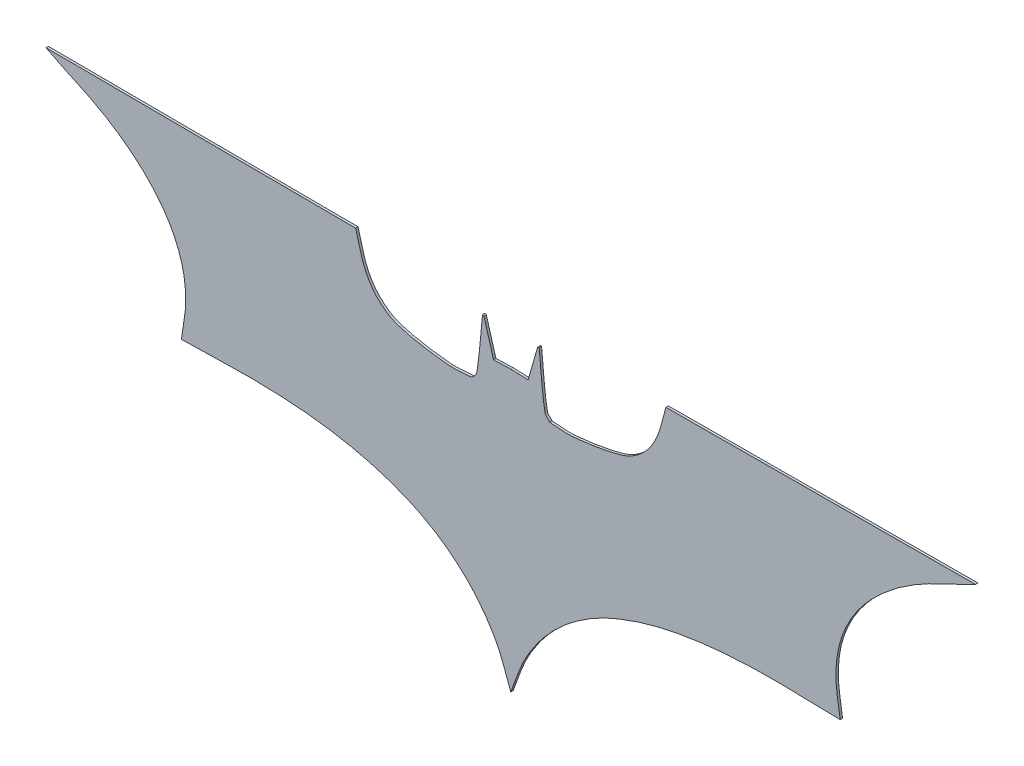
ISO-10303-21;
HEADER;
FILE_DESCRIPTION(('STEP AP214'),'2;1');
FILE_NAME('part.step','',(''),(''),'','','');
FILE_SCHEMA(('AUTOMOTIVE_DESIGN { 1 0 10303 214 1 1 1 1 }'));
ENDSEC;
DATA;
#1=APPLICATION_CONTEXT('core data for automotive mechanical design processes');
#2=APPLICATION_PROTOCOL_DEFINITION('international standard','automotive_design',2000,#1);
#3=PRODUCT_CONTEXT('',#1,'mechanical');
#4=PRODUCT('Part','Part','',(#3));
#5=PRODUCT_RELATED_PRODUCT_CATEGORY('part','',(#4));
#6=PRODUCT_DEFINITION_FORMATION('','',#4);
#7=PRODUCT_DEFINITION_CONTEXT('part definition',#1,'design');
#8=PRODUCT_DEFINITION('design','',#6,#7);
#9=PRODUCT_DEFINITION_SHAPE('','',#8);
#10=(LENGTH_UNIT() NAMED_UNIT(*) SI_UNIT(.MILLI.,.METRE.));
#11=(NAMED_UNIT(*) PLANE_ANGLE_UNIT() SI_UNIT($,.RADIAN.));
#12=(NAMED_UNIT(*) SI_UNIT($,.STERADIAN.) SOLID_ANGLE_UNIT());
#13=UNCERTAINTY_MEASURE_WITH_UNIT(LENGTH_MEASURE(1.E-05),#10,'distance_accuracy_value','');
#14=(GEOMETRIC_REPRESENTATION_CONTEXT(3) GLOBAL_UNCERTAINTY_ASSIGNED_CONTEXT((#13)) GLOBAL_UNIT_ASSIGNED_CONTEXT((#10,
#11,#12)) REPRESENTATION_CONTEXT('',''));
#15=CARTESIAN_POINT('',(0.,0.,0.));
#16=DIRECTION('',(0.,0.,1.));
#17=DIRECTION('',(1.,0.,0.));
#18=AXIS2_PLACEMENT_3D('',#15,#16,#17);
#19=CARTESIAN_POINT('',(24.,709.,5.));
#20=CARTESIAN_POINT('',(64.0321290435499,687.444238207319,5.));
#21=CARTESIAN_POINT('',(106.843725270585,671.108621151786,5.));
#22=CARTESIAN_POINT('',(146.,648.,5.));
#23=CARTESIAN_POINT('',(172.297790869574,632.479992273694,5.));
#24=CARTESIAN_POINT('',(197.276133100903,614.397801783441,5.));
#25=CARTESIAN_POINT('',(220.,594.,5.));
#26=CARTESIAN_POINT('',(239.858417409562,576.174333978818,5.));
#27=CARTESIAN_POINT('',(258.07626884736,556.122236767443,5.));
#28=CARTESIAN_POINT('',(273.,534.,5.));
#29=CARTESIAN_POINT('',(286.673302399037,513.731339973193,5.));
#30=CARTESIAN_POINT('',(297.687502708865,491.330348500289,5.));
#31=CARTESIAN_POINT('',(305.,468.,5.));
#32=CARTESIAN_POINT('',(311.852192021314,446.138244503427,5.));
#33=CARTESIAN_POINT('',(314.840903463254,422.909901291382,5.));
#34=CARTESIAN_POINT('',(315.,400.,5.));
#35=CARTESIAN_POINT('',(315.177150912395,374.490268615056,5.));
#36=CARTESIAN_POINT('',(309.,349.333333333333,5.));
#37=CARTESIAN_POINT('',(306.,324.,5.));
#38=B_SPLINE_CURVE_WITH_KNOTS('',3,(#19,#20,#21,#22,#23,#24,#25,#26,#27,#28,#29,#30,#31,#32,#33,
#34,#35,#36,#37),.UNSPECIFIED.,.F.,.F.,(4,3,3,3,3,3,4),(0.,1.,2.,3.,4.,5.,6.),.UNSPECIFIED.);
#39=DIRECTION('',(0.,0.,-1.));
#40=VECTOR('',#39,1.);
#41=SURFACE_OF_LINEAR_EXTRUSION('',#38,#40);
#42=CARTESIAN_POINT('',(24.,709.,0.));
#43=CARTESIAN_POINT('',(64.0321290435499,687.444238207319,0.));
#44=CARTESIAN_POINT('',(106.843725270585,671.108621151786,0.));
#45=CARTESIAN_POINT('',(146.,648.,0.));
#46=CARTESIAN_POINT('',(172.297790869574,632.479992273694,0.));
#47=CARTESIAN_POINT('',(197.276133100903,614.397801783441,0.));
#48=CARTESIAN_POINT('',(220.,594.,0.));
#49=CARTESIAN_POINT('',(239.858417409562,576.174333978818,0.));
#50=CARTESIAN_POINT('',(258.07626884736,556.122236767443,0.));
#51=CARTESIAN_POINT('',(273.,534.,0.));
#52=CARTESIAN_POINT('',(286.673302399037,513.731339973193,0.));
#53=CARTESIAN_POINT('',(297.687502708865,491.330348500289,0.));
#54=CARTESIAN_POINT('',(305.,468.,0.));
#55=CARTESIAN_POINT('',(311.852192021314,446.138244503427,0.));
#56=CARTESIAN_POINT('',(314.840903463254,422.909901291382,0.));
#57=CARTESIAN_POINT('',(315.,400.,0.));
#58=CARTESIAN_POINT('',(315.177150912395,374.490268615056,0.));
#59=CARTESIAN_POINT('',(309.,349.333333333333,0.));
#60=CARTESIAN_POINT('',(306.,324.,0.));
#61=B_SPLINE_CURVE_WITH_KNOTS('',3,(#42,#43,#44,#45,#46,#47,#48,#49,#50,#51,#52,#53,#54,#55,#56,
#57,#58,#59,#60),.UNSPECIFIED.,.F.,.F.,(4,3,3,3,3,3,4),(0.,1.,2.,3.,4.,5.,6.),.UNSPECIFIED.);
#62=CARTESIAN_POINT('',(24.,709.,0.));
#63=VERTEX_POINT('',#62);
#64=CARTESIAN_POINT('',(306.,324.,0.));
#65=VERTEX_POINT('',#64);
#66=EDGE_CURVE('E307',#63,#65,#61,.T.);
#67=ORIENTED_EDGE('',*,*,#66,.T.);
#68=DIRECTION('',(0.,0.,-1.));
#69=VECTOR('',#68,1.);
#70=CARTESIAN_POINT('',(306.,324.,5.));
#71=LINE('',#70,#69);
#72=CARTESIAN_POINT('',(306.,324.,5.));
#73=VERTEX_POINT('',#72);
#74=EDGE_CURVE('E11',#73,#65,#71,.T.);
#75=ORIENTED_EDGE('',*,*,#74,.F.);
#76=CARTESIAN_POINT('',(24.,709.,5.));
#77=VERTEX_POINT('',#76);
#78=EDGE_CURVE('E360',#77,#73,#38,.T.);
#79=ORIENTED_EDGE('',*,*,#78,.F.);
#80=DIRECTION('',(0.,0.,-1.));
#81=VECTOR('',#80,1.);
#82=CARTESIAN_POINT('',(24.,709.,5.));
#83=LINE('',#82,#81);
#84=EDGE_CURVE('E174',#77,#63,#83,.T.);
#85=ORIENTED_EDGE('',*,*,#84,.T.);
#86=EDGE_LOOP('',(#67,#75,#79,#85));
#87=FACE_BOUND('',#86,.T.);
#88=ADVANCED_FACE('F33',(#87),#41,.F.);
#89=CARTESIAN_POINT('',(306.,324.,5.));
#90=CARTESIAN_POINT('',(336.,324.666666666667,5.));
#91=CARTESIAN_POINT('',(366.0081939272,325.032522384748,5.));
#92=CARTESIAN_POINT('',(396.,326.,5.));
#93=CARTESIAN_POINT('',(450.321435164384,327.752304360141,5.));
#94=CARTESIAN_POINT('',(504.859669997663,326.765874119924,5.));
#95=CARTESIAN_POINT('',(559.,322.,5.));
#96=CARTESIAN_POINT('',(600.706237792641,318.328676250648,5.));
#97=CARTESIAN_POINT('',(642.288559158832,311.77074580188,5.));
#98=CARTESIAN_POINT('',(683.,302.,5.));
#99=CARTESIAN_POINT('',(717.542187487519,293.709875002995,5.));
#100=CARTESIAN_POINT('',(751.485195049652,282.306514178153,5.));
#101=CARTESIAN_POINT('',(784.,268.,5.));
#102=CARTESIAN_POINT('',(810.112782699585,256.510375612182,5.));
#103=CARTESIAN_POINT('',(834.950283850925,241.810695236544,5.));
#104=CARTESIAN_POINT('',(858.,225.,5.));
#105=CARTESIAN_POINT('',(879.540210465079,209.290222442762,5.));
#106=CARTESIAN_POINT('',(899.455939229453,191.074454150914,5.));
#107=CARTESIAN_POINT('',(917.,171.,5.));
#108=CARTESIAN_POINT('',(934.341312172488,151.157537033403,5.));
#109=CARTESIAN_POINT('',(949.555873137911,129.229036809233,5.));
#110=CARTESIAN_POINT('',(962.,106.,5.));
#111=CARTESIAN_POINT('',(974.714950659267,82.2654254360351,5.));
#112=CARTESIAN_POINT('',(982.,55.9999999999999,5.));
#113=CARTESIAN_POINT('',(992.,31.,5.));
#114=B_SPLINE_CURVE_WITH_KNOTS('',3,(#89,#90,#91,#92,#93,#94,#95,#96,#97,#98,#99,#100,#101,#102,
#103,#104,#105,#106,#107,#108,#109,#110,#111,#112,#113),.UNSPECIFIED.,.F.,.F.,(4,3,3,3,3,3,3,3,
4),(0.,1.,2.,3.,4.,5.,6.,7.,8.),.UNSPECIFIED.);
#115=DIRECTION('',(0.,0.,-1.));
#116=VECTOR('',#115,1.);
#117=SURFACE_OF_LINEAR_EXTRUSION('',#114,#116);
#118=CARTESIAN_POINT('',(306.,324.,0.));
#119=CARTESIAN_POINT('',(336.,324.666666666667,0.));
#120=CARTESIAN_POINT('',(366.0081939272,325.032522384748,0.));
#121=CARTESIAN_POINT('',(396.,326.,0.));
#122=CARTESIAN_POINT('',(450.321435164384,327.752304360141,0.));
#123=CARTESIAN_POINT('',(504.859669997663,326.765874119924,0.));
#124=CARTESIAN_POINT('',(559.,322.,0.));
#125=CARTESIAN_POINT('',(600.706237792641,318.328676250648,0.));
#126=CARTESIAN_POINT('',(642.288559158832,311.77074580188,0.));
#127=CARTESIAN_POINT('',(683.,302.,0.));
#128=CARTESIAN_POINT('',(717.542187487519,293.709875002995,0.));
#129=CARTESIAN_POINT('',(751.485195049652,282.306514178153,0.));
#130=CARTESIAN_POINT('',(784.,268.,0.));
#131=CARTESIAN_POINT('',(810.112782699585,256.510375612182,0.));
#132=CARTESIAN_POINT('',(834.950283850925,241.810695236544,0.));
#133=CARTESIAN_POINT('',(858.,225.,0.));
#134=CARTESIAN_POINT('',(879.540210465079,209.290222442762,0.));
#135=CARTESIAN_POINT('',(899.455939229453,191.074454150914,0.));
#136=CARTESIAN_POINT('',(917.,171.,0.));
#137=CARTESIAN_POINT('',(934.341312172488,151.157537033403,0.));
#138=CARTESIAN_POINT('',(949.555873137911,129.229036809233,0.));
#139=CARTESIAN_POINT('',(962.,106.,0.));
#140=CARTESIAN_POINT('',(974.714950659267,82.2654254360351,0.));
#141=CARTESIAN_POINT('',(982.,55.9999999999999,0.));
#142=CARTESIAN_POINT('',(992.,31.,0.));
#143=B_SPLINE_CURVE_WITH_KNOTS('',3,(#118,#119,#120,#121,#122,#123,#124,#125,#126,#127,#128,
#129,#130,#131,#132,#133,#134,#135,#136,#137,#138,#139,#140,#141,#142),.UNSPECIFIED.,.F.,.F.,(4,
3,3,3,3,3,3,3,4),(0.,1.,2.,3.,4.,5.,6.,7.,8.),.UNSPECIFIED.);
#144=CARTESIAN_POINT('',(992.,31.,0.));
#145=VERTEX_POINT('',#144);
#146=EDGE_CURVE('E301',#65,#145,#143,.T.);
#147=ORIENTED_EDGE('',*,*,#146,.T.);
#148=DIRECTION('',(0.,0.,-1.));
#149=VECTOR('',#148,1.);
#150=CARTESIAN_POINT('',(992.,31.,5.));
#151=LINE('',#150,#149);
#152=CARTESIAN_POINT('',(992.,31.,5.));
#153=VERTEX_POINT('',#152);
#154=EDGE_CURVE('E42',#153,#145,#151,.T.);
#155=ORIENTED_EDGE('',*,*,#154,.F.);
#156=EDGE_CURVE('E117',#73,#153,#114,.T.);
#157=ORIENTED_EDGE('',*,*,#156,.F.);
#158=ORIENTED_EDGE('',*,*,#74,.T.);
#159=EDGE_LOOP('',(#147,#155,#157,#158));
#160=FACE_BOUND('',#159,.T.);
#161=ADVANCED_FACE('F388',(#160),#117,.F.);
#162=CARTESIAN_POINT('',(992.,31.,5.));
#163=CARTESIAN_POINT('',(1002.,55.9999999999999,5.));
#164=CARTESIAN_POINT('',(1009.28504934073,82.2654254360351,5.));
#165=CARTESIAN_POINT('',(1022.,106.,5.));
#166=CARTESIAN_POINT('',(1034.44412686209,129.229036809233,5.));
#167=CARTESIAN_POINT('',(1049.65868782751,151.157537033403,5.));
#168=CARTESIAN_POINT('',(1067.,171.,5.));
#169=CARTESIAN_POINT('',(1084.54406077055,191.074454150914,5.));
#170=CARTESIAN_POINT('',(1104.45978953492,209.290222442762,5.));
#171=CARTESIAN_POINT('',(1126.,225.,5.));
#172=CARTESIAN_POINT('',(1149.04971614908,241.810695236544,5.));
#173=CARTESIAN_POINT('',(1173.88721730041,256.510375612182,5.));
#174=CARTESIAN_POINT('',(1200.,268.,5.));
#175=CARTESIAN_POINT('',(1232.51480495035,282.306514178153,5.));
#176=CARTESIAN_POINT('',(1266.45781251248,293.709875002995,5.));
#177=CARTESIAN_POINT('',(1301.,302.,5.));
#178=CARTESIAN_POINT('',(1341.71144084117,311.77074580188,5.));
#179=CARTESIAN_POINT('',(1383.29376220736,318.328676250648,5.));
#180=CARTESIAN_POINT('',(1425.,322.,5.));
#181=CARTESIAN_POINT('',(1479.14033000234,326.765874119924,5.));
#182=CARTESIAN_POINT('',(1533.67856483562,327.752304360141,5.));
#183=CARTESIAN_POINT('',(1588.,326.,5.));
#184=CARTESIAN_POINT('',(1617.9918060728,325.032522384748,5.));
#185=CARTESIAN_POINT('',(1648.,324.666666666667,5.));
#186=CARTESIAN_POINT('',(1678.,324.,5.));
#187=B_SPLINE_CURVE_WITH_KNOTS('',3,(#162,#163,#164,#165,#166,#167,#168,#169,#170,#171,#172,
#173,#174,#175,#176,#177,#178,#179,#180,#181,#182,#183,#184,#185,#186),.UNSPECIFIED.,.F.,.F.,(4,
3,3,3,3,3,3,3,4),(0.,1.,2.,3.,4.,5.,6.,7.,8.),.UNSPECIFIED.);
#188=DIRECTION('',(0.,0.,-1.));
#189=VECTOR('',#188,1.);
#190=SURFACE_OF_LINEAR_EXTRUSION('',#187,#189);
#191=CARTESIAN_POINT('',(992.,31.,0.));
#192=CARTESIAN_POINT('',(1002.,55.9999999999999,0.));
#193=CARTESIAN_POINT('',(1009.28504934073,82.2654254360351,0.));
#194=CARTESIAN_POINT('',(1022.,106.,0.));
#195=CARTESIAN_POINT('',(1034.44412686209,129.229036809233,0.));
#196=CARTESIAN_POINT('',(1049.65868782751,151.157537033403,0.));
#197=CARTESIAN_POINT('',(1067.,171.,0.));
#198=CARTESIAN_POINT('',(1084.54406077055,191.074454150914,0.));
#199=CARTESIAN_POINT('',(1104.45978953492,209.290222442762,0.));
#200=CARTESIAN_POINT('',(1126.,225.,0.));
#201=CARTESIAN_POINT('',(1149.04971614908,241.810695236544,0.));
#202=CARTESIAN_POINT('',(1173.88721730041,256.510375612182,0.));
#203=CARTESIAN_POINT('',(1200.,268.,0.));
#204=CARTESIAN_POINT('',(1232.51480495035,282.306514178153,0.));
#205=CARTESIAN_POINT('',(1266.45781251248,293.709875002995,0.));
#206=CARTESIAN_POINT('',(1301.,302.,0.));
#207=CARTESIAN_POINT('',(1341.71144084117,311.77074580188,0.));
#208=CARTESIAN_POINT('',(1383.29376220736,318.328676250648,0.));
#209=CARTESIAN_POINT('',(1425.,322.,0.));
#210=CARTESIAN_POINT('',(1479.14033000234,326.765874119924,0.));
#211=CARTESIAN_POINT('',(1533.67856483562,327.752304360141,0.));
#212=CARTESIAN_POINT('',(1588.,326.,0.));
#213=CARTESIAN_POINT('',(1617.9918060728,325.032522384748,0.));
#214=CARTESIAN_POINT('',(1648.,324.666666666667,0.));
#215=CARTESIAN_POINT('',(1678.,324.,0.));
#216=B_SPLINE_CURVE_WITH_KNOTS('',3,(#191,#192,#193,#194,#195,#196,#197,#198,#199,#200,#201,
#202,#203,#204,#205,#206,#207,#208,#209,#210,#211,#212,#213,#214,#215),.UNSPECIFIED.,.F.,.F.,(4,
3,3,3,3,3,3,3,4),(0.,1.,2.,3.,4.,5.,6.,7.,8.),.UNSPECIFIED.);
#217=CARTESIAN_POINT('',(1678.,324.,0.));
#218=VERTEX_POINT('',#217);
#219=EDGE_CURVE('E295',#145,#218,#216,.T.);
#220=ORIENTED_EDGE('',*,*,#219,.T.);
#221=DIRECTION('',(0.,0.,-1.));
#222=VECTOR('',#221,1.);
#223=CARTESIAN_POINT('',(1678.,324.,5.));
#224=LINE('',#223,#222);
#225=CARTESIAN_POINT('',(1678.,324.,5.));
#226=VERTEX_POINT('',#225);
#227=EDGE_CURVE('E287',#226,#218,#224,.T.);
#228=ORIENTED_EDGE('',*,*,#227,.F.);
#229=EDGE_CURVE('E296',#153,#226,#187,.T.);
#230=ORIENTED_EDGE('',*,*,#229,.F.);
#231=ORIENTED_EDGE('',*,*,#154,.T.);
#232=EDGE_LOOP('',(#220,#228,#230,#231));
#233=FACE_BOUND('',#232,.T.);
#234=ADVANCED_FACE('F293',(#233),#190,.F.);
#235=CARTESIAN_POINT('',(1678.,324.,5.));
#236=CARTESIAN_POINT('',(1675.,349.333333333333,5.));
#237=CARTESIAN_POINT('',(1668.8228490876,374.490268615056,5.));
#238=CARTESIAN_POINT('',(1669.,400.,5.));
#239=CARTESIAN_POINT('',(1669.15909653675,422.909901291382,5.));
#240=CARTESIAN_POINT('',(1672.14780797869,446.138244503427,5.));
#241=CARTESIAN_POINT('',(1679.,468.,5.));
#242=CARTESIAN_POINT('',(1686.31249729114,491.330348500289,5.));
#243=CARTESIAN_POINT('',(1697.32669760096,513.731339973193,5.));
#244=CARTESIAN_POINT('',(1711.,534.,5.));
#245=CARTESIAN_POINT('',(1725.92373115264,556.122236767443,5.));
#246=CARTESIAN_POINT('',(1744.14158259044,576.174333978818,5.));
#247=CARTESIAN_POINT('',(1764.,594.,5.));
#248=CARTESIAN_POINT('',(1786.7238668991,614.397801783441,5.));
#249=CARTESIAN_POINT('',(1811.70220913043,632.479992273694,5.));
#250=CARTESIAN_POINT('',(1838.,648.,5.));
#251=CARTESIAN_POINT('',(1877.15627472942,671.108621151786,5.));
#252=CARTESIAN_POINT('',(1919.96787095645,687.444238207319,5.));
#253=CARTESIAN_POINT('',(1960.,709.,5.));
#254=B_SPLINE_CURVE_WITH_KNOTS('',3,(#235,#236,#237,#238,#239,#240,#241,#242,#243,#244,#245,
#246,#247,#248,#249,#250,#251,#252,#253),.UNSPECIFIED.,.F.,.F.,(4,3,3,3,3,3,4),(0.,1.,2.,3.,4.,
5.,6.),.UNSPECIFIED.);
#255=DIRECTION('',(0.,0.,-1.));
#256=VECTOR('',#255,1.);
#257=SURFACE_OF_LINEAR_EXTRUSION('',#254,#256);
#258=CARTESIAN_POINT('',(1678.,324.,0.));
#259=CARTESIAN_POINT('',(1675.,349.333333333333,0.));
#260=CARTESIAN_POINT('',(1668.8228490876,374.490268615056,0.));
#261=CARTESIAN_POINT('',(1669.,400.,0.));
#262=CARTESIAN_POINT('',(1669.15909653675,422.909901291382,0.));
#263=CARTESIAN_POINT('',(1672.14780797869,446.138244503427,0.));
#264=CARTESIAN_POINT('',(1679.,468.,0.));
#265=CARTESIAN_POINT('',(1686.31249729114,491.330348500289,0.));
#266=CARTESIAN_POINT('',(1697.32669760096,513.731339973193,0.));
#267=CARTESIAN_POINT('',(1711.,534.,0.));
#268=CARTESIAN_POINT('',(1725.92373115264,556.122236767443,0.));
#269=CARTESIAN_POINT('',(1744.14158259044,576.174333978818,0.));
#270=CARTESIAN_POINT('',(1764.,594.,0.));
#271=CARTESIAN_POINT('',(1786.7238668991,614.397801783441,0.));
#272=CARTESIAN_POINT('',(1811.70220913043,632.479992273694,0.));
#273=CARTESIAN_POINT('',(1838.,648.,0.));
#274=CARTESIAN_POINT('',(1877.15627472942,671.108621151786,0.));
#275=CARTESIAN_POINT('',(1919.96787095645,687.444238207319,0.));
#276=CARTESIAN_POINT('',(1960.,709.,0.));
#277=B_SPLINE_CURVE_WITH_KNOTS('',3,(#258,#259,#260,#261,#262,#263,#264,#265,#266,#267,#268,
#269,#270,#271,#272,#273,#274,#275,#276),.UNSPECIFIED.,.F.,.F.,(4,3,3,3,3,3,4),(0.,1.,2.,3.,4.,
5.,6.),.UNSPECIFIED.);
#278=CARTESIAN_POINT('',(1960.,709.,0.));
#279=VERTEX_POINT('',#278);
#280=EDGE_CURVE('E303',#218,#279,#277,.T.);
#281=ORIENTED_EDGE('',*,*,#280,.T.);
#282=DIRECTION('',(0.,0.,-1.));
#283=VECTOR('',#282,1.);
#284=CARTESIAN_POINT('',(1960.,709.,5.));
#285=LINE('',#284,#283);
#286=CARTESIAN_POINT('',(1960.,709.,5.));
#287=VERTEX_POINT('',#286);
#288=EDGE_CURVE('E284',#287,#279,#285,.T.);
#289=ORIENTED_EDGE('',*,*,#288,.F.);
#290=EDGE_CURVE('E397',#226,#287,#254,.T.);
#291=ORIENTED_EDGE('',*,*,#290,.F.);
#292=ORIENTED_EDGE('',*,*,#227,.T.);
#293=EDGE_LOOP('',(#281,#289,#291,#292));
#294=FACE_BOUND('',#293,.T.);
#295=ADVANCED_FACE('F393',(#294),#257,.F.);
#296=CARTESIAN_POINT('',(1960.,709.,5.));
#297=DIRECTION('',(0.00465111248147835,-0.999989183517844,0.));
#298=DIRECTION('',(0.999989183517844,0.00465111248147835,0.));
#299=AXIS2_PLACEMENT_3D('',#296,#297,#298);
#300=PLANE('',#299);
#301=DIRECTION('',(-0.999989183517844,-0.00465111248147835,0.));
#302=VECTOR('',#301,1.);
#303=CARTESIAN_POINT('',(1960.,709.,0.));
#304=LINE('',#303,#302);
#305=CARTESIAN_POINT('',(1315.,706.,0.));
#306=VERTEX_POINT('',#305);
#307=EDGE_CURVE('E305',#279,#306,#304,.T.);
#308=ORIENTED_EDGE('',*,*,#307,.T.);
#309=DIRECTION('',(0.,0.,-1.));
#310=VECTOR('',#309,1.);
#311=CARTESIAN_POINT('',(1315.,706.,5.));
#312=LINE('',#311,#310);
#313=CARTESIAN_POINT('',(1315.,706.,5.));
#314=VERTEX_POINT('',#313);
#315=EDGE_CURVE('E281',#314,#306,#312,.T.);
#316=ORIENTED_EDGE('',*,*,#315,.F.);
#317=DIRECTION('',(-0.999989183517844,-0.00465111248147835,0.));
#318=VECTOR('',#317,1.);
#319=CARTESIAN_POINT('',(1960.,709.,5.));
#320=LINE('',#319,#318);
#321=EDGE_CURVE('E401',#287,#314,#320,.T.);
#322=ORIENTED_EDGE('',*,*,#321,.F.);
#323=ORIENTED_EDGE('',*,*,#288,.T.);
#324=EDGE_LOOP('',(#308,#316,#322,#323));
#325=FACE_BOUND('',#324,.T.);
#326=ADVANCED_FACE('F395',(#325),#300,.F.);
#327=CARTESIAN_POINT('',(1315.,706.,5.));
#328=CARTESIAN_POINT('',(1308.33333333333,684.,5.));
#329=CARTESIAN_POINT('',(1304.5712985177,660.900590640687,5.));
#330=CARTESIAN_POINT('',(1295.,640.,5.));
#331=CARTESIAN_POINT('',(1288.03016527678,624.780156828888,5.));
#332=CARTESIAN_POINT('',(1278.26069310113,610.397264009498,5.));
#333=CARTESIAN_POINT('',(1266.,599.,5.));
#334=CARTESIAN_POINT('',(1254.06697486362,587.907328746465,5.));
#335=CARTESIAN_POINT('',(1239.593210718,578.721887752634,5.));
#336=CARTESIAN_POINT('',(1224.,574.,5.));
#337=CARTESIAN_POINT('',(1191.58459360188,564.184067076627,5.));
#338=CARTESIAN_POINT('',(1157.68048143256,559.568792734575,5.));
#339=CARTESIAN_POINT('',(1124.,556.,5.));
#340=CARTESIAN_POINT('',(1107.08164410277,554.207326527446,5.));
#341=CARTESIAN_POINT('',(1090.,557.333333333333,5.));
#342=CARTESIAN_POINT('',(1073.,558.,5.));
#343=B_SPLINE_CURVE_WITH_KNOTS('',3,(#327,#328,#329,#330,#331,#332,#333,#334,#335,#336,#337,
#338,#339,#340,#341,#342),.UNSPECIFIED.,.F.,.F.,(4,3,3,3,3,4),(0.,1.,2.,3.,4.,5.),.UNSPECIFIED.);
#344=DIRECTION('',(0.,0.,-1.));
#345=VECTOR('',#344,1.);
#346=SURFACE_OF_LINEAR_EXTRUSION('',#343,#345);
#347=CARTESIAN_POINT('',(1315.,706.,0.));
#348=CARTESIAN_POINT('',(1308.33333333333,684.,0.));
#349=CARTESIAN_POINT('',(1304.5712985177,660.900590640687,0.));
#350=CARTESIAN_POINT('',(1295.,640.,0.));
#351=CARTESIAN_POINT('',(1288.03016527678,624.780156828888,0.));
#352=CARTESIAN_POINT('',(1278.26069310113,610.397264009498,0.));
#353=CARTESIAN_POINT('',(1266.,599.,0.));
#354=CARTESIAN_POINT('',(1254.06697486362,587.907328746465,0.));
#355=CARTESIAN_POINT('',(1239.593210718,578.721887752634,0.));
#356=CARTESIAN_POINT('',(1224.,574.,0.));
#357=CARTESIAN_POINT('',(1191.58459360188,564.184067076627,0.));
#358=CARTESIAN_POINT('',(1157.68048143256,559.568792734575,0.));
#359=CARTESIAN_POINT('',(1124.,556.,0.));
#360=CARTESIAN_POINT('',(1107.08164410277,554.207326527446,0.));
#361=CARTESIAN_POINT('',(1090.,557.333333333333,0.));
#362=CARTESIAN_POINT('',(1073.,558.,0.));
#363=B_SPLINE_CURVE_WITH_KNOTS('',3,(#347,#348,#349,#350,#351,#352,#353,#354,#355,#356,#357,
#358,#359,#360,#361,#362),.UNSPECIFIED.,.F.,.F.,(4,3,3,3,3,4),(0.,1.,2.,3.,4.,5.),.UNSPECIFIED.);
#364=CARTESIAN_POINT('',(1073.,558.,0.));
#365=VERTEX_POINT('',#364);
#366=EDGE_CURVE('E323',#306,#365,#363,.T.);
#367=ORIENTED_EDGE('',*,*,#366,.T.);
#368=DIRECTION('',(0.,0.,-1.));
#369=VECTOR('',#368,1.);
#370=CARTESIAN_POINT('',(1073.,558.,5.));
#371=LINE('',#370,#369);
#372=CARTESIAN_POINT('',(1073.,558.,5.));
#373=VERTEX_POINT('',#372);
#374=EDGE_CURVE('E278',#373,#365,#371,.T.);
#375=ORIENTED_EDGE('',*,*,#374,.F.);
#376=EDGE_CURVE('E233',#314,#373,#343,.T.);
#377=ORIENTED_EDGE('',*,*,#376,.F.);
#378=ORIENTED_EDGE('',*,*,#315,.T.);
#379=EDGE_LOOP('',(#367,#375,#377,#378));
#380=FACE_BOUND('',#379,.T.);
#381=ADVANCED_FACE('F223',(#380),#346,.F.);
#382=CARTESIAN_POINT('',(1073.,558.,5.));
#383=CARTESIAN_POINT('',(1069.66666666667,562.333333333333,5.));
#384=CARTESIAN_POINT('',(1063.95504970465,565.616992573799,5.));
#385=CARTESIAN_POINT('',(1063.,571.,5.));
#386=CARTESIAN_POINT('',(1056.49876333425,607.643333934235,5.));
#387=CARTESIAN_POINT('',(1055.,645.,5.));
#388=CARTESIAN_POINT('',(1051.,682.,5.));
#389=B_SPLINE_CURVE_WITH_KNOTS('',3,(#382,#383,#384,#385,#386,#387,#388),.UNSPECIFIED.,.F.,.F.,
(4,3,4),(0.,1.,2.),.UNSPECIFIED.);
#390=DIRECTION('',(0.,0.,-1.));
#391=VECTOR('',#390,1.);
#392=SURFACE_OF_LINEAR_EXTRUSION('',#389,#391);
#393=CARTESIAN_POINT('',(1073.,558.,0.));
#394=CARTESIAN_POINT('',(1069.66666666667,562.333333333333,0.));
#395=CARTESIAN_POINT('',(1063.95504970465,565.616992573799,0.));
#396=CARTESIAN_POINT('',(1063.,571.,0.));
#397=CARTESIAN_POINT('',(1056.49876333425,607.643333934235,0.));
#398=CARTESIAN_POINT('',(1055.,645.,0.));
#399=CARTESIAN_POINT('',(1051.,682.,0.));
#400=B_SPLINE_CURVE_WITH_KNOTS('',3,(#393,#394,#395,#396,#397,#398,#399),.UNSPECIFIED.,.F.,.F.,
(4,3,4),(0.,1.,2.),.UNSPECIFIED.);
#401=CARTESIAN_POINT('',(1051.,682.,0.));
#402=VERTEX_POINT('',#401);
#403=EDGE_CURVE('E327',#365,#402,#400,.T.);
#404=ORIENTED_EDGE('',*,*,#403,.T.);
#405=DIRECTION('',(0.,0.,-1.));
#406=VECTOR('',#405,1.);
#407=CARTESIAN_POINT('',(1051.,682.,5.));
#408=LINE('',#407,#406);
#409=CARTESIAN_POINT('',(1051.,682.,5.));
#410=VERTEX_POINT('',#409);
#411=EDGE_CURVE('E275',#410,#402,#408,.T.);
#412=ORIENTED_EDGE('',*,*,#411,.F.);
#413=EDGE_CURVE('E227',#373,#410,#389,.T.);
#414=ORIENTED_EDGE('',*,*,#413,.F.);
#415=ORIENTED_EDGE('',*,*,#374,.T.);
#416=EDGE_LOOP('',(#404,#412,#414,#415));
#417=FACE_BOUND('',#416,.T.);
#418=ADVANCED_FACE('F218',(#417),#392,.F.);
#419=CARTESIAN_POINT('',(1051.,682.,5.));
#420=DIRECTION('',(0.316227766016848,-0.94868329805051,0.));
#421=DIRECTION('',(0.94868329805051,0.316227766016849,0.));
#422=AXIS2_PLACEMENT_3D('',#419,#420,#421);
#423=PLANE('',#422);
#424=DIRECTION('',(-0.94868329805051,-0.316227766016848,0.));
#425=VECTOR('',#424,1.);
#426=CARTESIAN_POINT('',(1051.,682.,0.));
#427=LINE('',#426,#425);
#428=CARTESIAN_POINT('',(1048.,681.,0.));
#429=VERTEX_POINT('',#428);
#430=EDGE_CURVE('E334',#402,#429,#427,.T.);
#431=ORIENTED_EDGE('',*,*,#430,.T.);
#432=DIRECTION('',(0.,0.,-1.));
#433=VECTOR('',#432,1.);
#434=CARTESIAN_POINT('',(1048.,681.,5.));
#435=LINE('',#434,#433);
#436=CARTESIAN_POINT('',(1048.,681.,5.));
#437=VERTEX_POINT('',#436);
#438=EDGE_CURVE('E272',#437,#429,#435,.T.);
#439=ORIENTED_EDGE('',*,*,#438,.F.);
#440=DIRECTION('',(-0.94868329805051,-0.316227766016848,0.));
#441=VECTOR('',#440,1.);
#442=CARTESIAN_POINT('',(1051.,682.,5.));
#443=LINE('',#442,#441);
#444=EDGE_CURVE('E232',#410,#437,#443,.T.);
#445=ORIENTED_EDGE('',*,*,#444,.F.);
#446=ORIENTED_EDGE('',*,*,#411,.T.);
#447=EDGE_LOOP('',(#431,#439,#445,#446));
#448=FACE_BOUND('',#447,.T.);
#449=ADVANCED_FACE('F214',(#448),#423,.F.);
#450=CARTESIAN_POINT('',(1048.,681.,5.));
#451=DIRECTION('',(0.960466366084608,-0.278396048140466,0.));
#452=DIRECTION('',(0.278396048140466,0.960466366084608,0.));
#453=AXIS2_PLACEMENT_3D('',#450,#451,#452);
#454=PLANE('',#453);
#455=DIRECTION('',(-0.278396048140466,-0.960466366084607,0.));
#456=VECTOR('',#455,1.);
#457=CARTESIAN_POINT('',(1048.,681.,0.));
#458=LINE('',#457,#456);
#459=CARTESIAN_POINT('',(1028.,612.,0.));
#460=VERTEX_POINT('',#459);
#461=EDGE_CURVE('E339',#429,#460,#458,.T.);
#462=ORIENTED_EDGE('',*,*,#461,.T.);
#463=DIRECTION('',(0.,0.,-1.));
#464=VECTOR('',#463,1.);
#465=CARTESIAN_POINT('',(1028.,612.,5.));
#466=LINE('',#465,#464);
#467=CARTESIAN_POINT('',(1028.,612.,5.));
#468=VERTEX_POINT('',#467);
#469=EDGE_CURVE('E269',#468,#460,#466,.T.);
#470=ORIENTED_EDGE('',*,*,#469,.F.);
#471=DIRECTION('',(-0.278396048140466,-0.960466366084607,0.));
#472=VECTOR('',#471,1.);
#473=CARTESIAN_POINT('',(1048.,681.,5.));
#474=LINE('',#473,#472);
#475=EDGE_CURVE('E242',#437,#468,#474,.T.);
#476=ORIENTED_EDGE('',*,*,#475,.F.);
#477=ORIENTED_EDGE('',*,*,#438,.T.);
#478=EDGE_LOOP('',(#462,#470,#476,#477));
#479=FACE_BOUND('',#478,.T.);
#480=ADVANCED_FACE('F210',(#479),#454,.F.);
#481=CARTESIAN_POINT('',(1028.,612.,5.));
#482=DIRECTION('',(-0.0384331221012056,-0.999261174631314,0.));
#483=DIRECTION('',(0.999261174631314,-0.0384331221012056,0.));
#484=AXIS2_PLACEMENT_3D('',#481,#482,#483);
#485=PLANE('',#484);
#486=DIRECTION('',(-0.999261174631314,0.0384331221012056,0.));
#487=VECTOR('',#486,1.);
#488=CARTESIAN_POINT('',(1028.,612.,0.));
#489=LINE('',#488,#487);
#490=CARTESIAN_POINT('',(992.,613.384615384615,0.));
#491=VERTEX_POINT('',#490);
#492=EDGE_CURVE('E341',#460,#491,#489,.T.);
#493=ORIENTED_EDGE('',*,*,#492,.T.);
#494=DIRECTION('',(0.,0.,-1.));
#495=VECTOR('',#494,1.);
#496=CARTESIAN_POINT('',(992.,613.384615384615,5.));
#497=LINE('',#496,#495);
#498=CARTESIAN_POINT('',(992.,613.384615384615,5.));
#499=VERTEX_POINT('',#498);
#500=EDGE_CURVE('E266',#499,#491,#497,.T.);
#501=ORIENTED_EDGE('',*,*,#500,.F.);
#502=DIRECTION('',(-0.999261174631314,0.0384331221012056,0.));
#503=VECTOR('',#502,1.);
#504=CARTESIAN_POINT('',(1028.,612.,5.));
#505=LINE('',#504,#503);
#506=EDGE_CURVE('E244',#468,#499,#505,.T.);
#507=ORIENTED_EDGE('',*,*,#506,.F.);
#508=ORIENTED_EDGE('',*,*,#469,.T.);
#509=EDGE_LOOP('',(#493,#501,#507,#508));
#510=FACE_BOUND('',#509,.T.);
#511=ADVANCED_FACE('F206',(#510),#485,.F.);
#512=CARTESIAN_POINT('',(956.,612.,5.));
#513=DIRECTION('',(0.0384331221012057,-0.999261174631314,0.));
#514=DIRECTION('',(0.999261174631314,0.0384331221012057,0.));
#515=AXIS2_PLACEMENT_3D('',#512,#513,#514);
#516=PLANE('',#515);
#517=DIRECTION('',(-0.999261174631314,-0.0384331221012057,0.));
#518=VECTOR('',#517,1.);
#519=CARTESIAN_POINT('',(956.,612.,0.));
#520=LINE('',#519,#518);
#521=CARTESIAN_POINT('',(956.,612.,0.));
#522=VERTEX_POINT('',#521);
#523=EDGE_CURVE('E343',#491,#522,#520,.T.);
#524=ORIENTED_EDGE('',*,*,#523,.T.);
#525=DIRECTION('',(0.,0.,-1.));
#526=VECTOR('',#525,1.);
#527=CARTESIAN_POINT('',(956.,612.,5.));
#528=LINE('',#527,#526);
#529=CARTESIAN_POINT('',(956.,612.,5.));
#530=VERTEX_POINT('',#529);
#531=EDGE_CURVE('E259',#530,#522,#528,.T.);
#532=ORIENTED_EDGE('',*,*,#531,.F.);
#533=DIRECTION('',(-0.999261174631314,-0.0384331221012057,0.));
#534=VECTOR('',#533,1.);
#535=CARTESIAN_POINT('',(956.,612.,5.));
#536=LINE('',#535,#534);
#537=EDGE_CURVE('E246',#499,#530,#536,.T.);
#538=ORIENTED_EDGE('',*,*,#537,.F.);
#539=ORIENTED_EDGE('',*,*,#500,.T.);
#540=EDGE_LOOP('',(#524,#532,#538,#539));
#541=FACE_BOUND('',#540,.T.);
#542=ADVANCED_FACE('F202',(#541),#516,.F.);
#543=CARTESIAN_POINT('',(936.,681.,5.));
#544=DIRECTION('',(-0.960466366084608,-0.278396048140466,0.));
#545=DIRECTION('',(0.278396048140466,-0.960466366084608,0.));
#546=AXIS2_PLACEMENT_3D('',#543,#544,#545);
#547=PLANE('',#546);
#548=DIRECTION('',(-0.278396048140466,0.960466366084607,0.));
#549=VECTOR('',#548,1.);
#550=CARTESIAN_POINT('',(936.,681.,0.));
#551=LINE('',#550,#549);
#552=CARTESIAN_POINT('',(936.,681.,0.));
#553=VERTEX_POINT('',#552);
#554=EDGE_CURVE('E257',#522,#553,#551,.T.);
#555=ORIENTED_EDGE('',*,*,#554,.T.);
#556=DIRECTION('',(0.,0.,-1.));
#557=VECTOR('',#556,1.);
#558=CARTESIAN_POINT('',(936.,681.,5.));
#559=LINE('',#558,#557);
#560=CARTESIAN_POINT('',(936.,681.,5.));
#561=VERTEX_POINT('',#560);
#562=EDGE_CURVE('E255',#561,#553,#559,.T.);
#563=ORIENTED_EDGE('',*,*,#562,.F.);
#564=DIRECTION('',(-0.278396048140466,0.960466366084607,0.));
#565=VECTOR('',#564,1.);
#566=CARTESIAN_POINT('',(936.,681.,5.));
#567=LINE('',#566,#565);
#568=EDGE_CURVE('E248',#530,#561,#567,.T.);
#569=ORIENTED_EDGE('',*,*,#568,.F.);
#570=ORIENTED_EDGE('',*,*,#531,.T.);
#571=EDGE_LOOP('',(#555,#563,#569,#570));
#572=FACE_BOUND('',#571,.T.);
#573=ADVANCED_FACE('F198',(#572),#547,.F.);
#574=CARTESIAN_POINT('',(933.,682.,5.));
#575=DIRECTION('',(-0.316227766016838,-0.948683298050514,0.));
#576=DIRECTION('',(0.948683298050514,-0.316227766016838,0.));
#577=AXIS2_PLACEMENT_3D('',#574,#575,#576);
#578=PLANE('',#577);
#579=DIRECTION('',(-0.948683298050514,0.316227766016838,0.));
#580=VECTOR('',#579,1.);
#581=CARTESIAN_POINT('',(933.,682.,0.));
#582=LINE('',#581,#580);
#583=CARTESIAN_POINT('',(933.,682.,0.));
#584=VERTEX_POINT('',#583);
#585=EDGE_CURVE('E261',#553,#584,#582,.T.);
#586=ORIENTED_EDGE('',*,*,#585,.T.);
#587=DIRECTION('',(0.,0.,-1.));
#588=VECTOR('',#587,1.);
#589=CARTESIAN_POINT('',(933.,682.,5.));
#590=LINE('',#589,#588);
#591=CARTESIAN_POINT('',(933.,682.,5.));
#592=VERTEX_POINT('',#591);
#593=EDGE_CURVE('E169',#592,#584,#590,.T.);
#594=ORIENTED_EDGE('',*,*,#593,.F.);
#595=DIRECTION('',(-0.948683298050514,0.316227766016838,0.));
#596=VECTOR('',#595,1.);
#597=CARTESIAN_POINT('',(933.,682.,5.));
#598=LINE('',#597,#596);
#599=EDGE_CURVE('E160',#561,#592,#598,.T.);
#600=ORIENTED_EDGE('',*,*,#599,.F.);
#601=ORIENTED_EDGE('',*,*,#562,.T.);
#602=EDGE_LOOP('',(#586,#594,#600,#601));
#603=FACE_BOUND('',#602,.T.);
#604=ADVANCED_FACE('F195',(#603),#578,.F.);
#605=CARTESIAN_POINT('',(933.,682.,5.));
#606=CARTESIAN_POINT('',(929.,645.,5.));
#607=CARTESIAN_POINT('',(927.501236665751,607.643333934235,5.));
#608=CARTESIAN_POINT('',(921.,571.,5.));
#609=CARTESIAN_POINT('',(920.044950295351,565.616992573799,5.));
#610=CARTESIAN_POINT('',(914.333333333333,562.333333333333,5.));
#611=CARTESIAN_POINT('',(911.,558.,5.));
#612=B_SPLINE_CURVE_WITH_KNOTS('',3,(#605,#606,#607,#608,#609,#610,#611),.UNSPECIFIED.,.F.,.F.,
(4,3,4),(0.,1.,2.),.UNSPECIFIED.);
#613=DIRECTION('',(0.,0.,-1.));
#614=VECTOR('',#613,1.);
#615=SURFACE_OF_LINEAR_EXTRUSION('',#612,#614);
#616=CARTESIAN_POINT('',(933.,682.,0.));
#617=CARTESIAN_POINT('',(929.,645.,0.));
#618=CARTESIAN_POINT('',(927.501236665751,607.643333934235,0.));
#619=CARTESIAN_POINT('',(921.,571.,0.));
#620=CARTESIAN_POINT('',(920.044950295351,565.616992573799,0.));
#621=CARTESIAN_POINT('',(914.333333333333,562.333333333333,0.));
#622=CARTESIAN_POINT('',(911.,558.,0.));
#623=B_SPLINE_CURVE_WITH_KNOTS('',3,(#616,#617,#618,#619,#620,#621,#622),.UNSPECIFIED.,.F.,.F.,
(4,3,4),(0.,1.,2.),.UNSPECIFIED.);
#624=CARTESIAN_POINT('',(911.,558.,0.));
#625=VERTEX_POINT('',#624);
#626=EDGE_CURVE('E168',#584,#625,#623,.T.);
#627=ORIENTED_EDGE('',*,*,#626,.T.);
#628=DIRECTION('',(0.,0.,-1.));
#629=VECTOR('',#628,1.);
#630=CARTESIAN_POINT('',(911.,558.,5.));
#631=LINE('',#630,#629);
#632=CARTESIAN_POINT('',(911.,558.,5.));
#633=VERTEX_POINT('',#632);
#634=EDGE_CURVE('E165',#633,#625,#631,.T.);
#635=ORIENTED_EDGE('',*,*,#634,.F.);
#636=EDGE_CURVE('E154',#592,#633,#612,.T.);
#637=ORIENTED_EDGE('',*,*,#636,.F.);
#638=ORIENTED_EDGE('',*,*,#593,.T.);
#639=EDGE_LOOP('',(#627,#635,#637,#638));
#640=FACE_BOUND('',#639,.T.);
#641=ADVANCED_FACE('F166',(#640),#615,.F.);
#642=CARTESIAN_POINT('',(911.,558.,5.));
#643=CARTESIAN_POINT('',(894.,557.333333333333,5.));
#644=CARTESIAN_POINT('',(876.918355897227,554.207326527446,5.));
#645=CARTESIAN_POINT('',(860.,556.,5.));
#646=CARTESIAN_POINT('',(826.319518567444,559.568792734575,5.));
#647=CARTESIAN_POINT('',(792.415406398115,564.184067076627,5.));
#648=CARTESIAN_POINT('',(760.,574.,5.));
#649=CARTESIAN_POINT('',(744.406789281999,578.721887752634,5.));
#650=CARTESIAN_POINT('',(729.933025136379,587.907328746465,5.));
#651=CARTESIAN_POINT('',(718.,599.,5.));
#652=CARTESIAN_POINT('',(705.739306898873,610.397264009498,5.));
#653=CARTESIAN_POINT('',(695.969834723219,624.780156828888,5.));
#654=CARTESIAN_POINT('',(689.,640.,5.));
#655=CARTESIAN_POINT('',(679.428701482302,660.900590640687,5.));
#656=CARTESIAN_POINT('',(675.666666666667,684.,5.));
#657=CARTESIAN_POINT('',(669.,706.,5.));
#658=B_SPLINE_CURVE_WITH_KNOTS('',3,(#642,#643,#644,#645,#646,#647,#648,#649,#650,#651,#652,
#653,#654,#655,#656,#657),.UNSPECIFIED.,.F.,.F.,(4,3,3,3,3,4),(0.,1.,2.,3.,4.,5.),.UNSPECIFIED.);
#659=DIRECTION('',(0.,0.,-1.));
#660=VECTOR('',#659,1.);
#661=SURFACE_OF_LINEAR_EXTRUSION('',#658,#660);
#662=CARTESIAN_POINT('',(911.,558.,0.));
#663=CARTESIAN_POINT('',(894.,557.333333333333,0.));
#664=CARTESIAN_POINT('',(876.918355897227,554.207326527446,0.));
#665=CARTESIAN_POINT('',(860.,556.,0.));
#666=CARTESIAN_POINT('',(826.319518567444,559.568792734575,0.));
#667=CARTESIAN_POINT('',(792.415406398115,564.184067076627,0.));
#668=CARTESIAN_POINT('',(760.,574.,0.));
#669=CARTESIAN_POINT('',(744.406789281999,578.721887752634,0.));
#670=CARTESIAN_POINT('',(729.933025136379,587.907328746465,0.));
#671=CARTESIAN_POINT('',(718.,599.,0.));
#672=CARTESIAN_POINT('',(705.739306898873,610.397264009498,0.));
#673=CARTESIAN_POINT('',(695.969834723219,624.780156828888,0.));
#674=CARTESIAN_POINT('',(689.,640.,0.));
#675=CARTESIAN_POINT('',(679.428701482302,660.900590640687,0.));
#676=CARTESIAN_POINT('',(675.666666666667,684.,0.));
#677=CARTESIAN_POINT('',(669.,706.,0.));
#678=B_SPLINE_CURVE_WITH_KNOTS('',3,(#662,#663,#664,#665,#666,#667,#668,#669,#670,#671,#672,
#673,#674,#675,#676,#677),.UNSPECIFIED.,.F.,.F.,(4,3,3,3,3,4),(0.,1.,2.,3.,4.,5.),.UNSPECIFIED.);
#679=CARTESIAN_POINT('',(669.,706.,0.));
#680=VERTEX_POINT('',#679);
#681=EDGE_CURVE('E103',#625,#680,#678,.T.);
#682=ORIENTED_EDGE('',*,*,#681,.T.);
#683=DIRECTION('',(0.,0.,-1.));
#684=VECTOR('',#683,1.);
#685=CARTESIAN_POINT('',(669.,706.,5.));
#686=LINE('',#685,#684);
#687=CARTESIAN_POINT('',(669.,706.,5.));
#688=VERTEX_POINT('',#687);
#689=EDGE_CURVE('E170',#688,#680,#686,.T.);
#690=ORIENTED_EDGE('',*,*,#689,.F.);
#691=EDGE_CURVE('E158',#633,#688,#658,.T.);
#692=ORIENTED_EDGE('',*,*,#691,.F.);
#693=ORIENTED_EDGE('',*,*,#634,.T.);
#694=EDGE_LOOP('',(#682,#690,#692,#693));
#695=FACE_BOUND('',#694,.T.);
#696=ADVANCED_FACE('F172',(#695),#661,.F.);
#697=CARTESIAN_POINT('',(24.,709.,5.));
#698=DIRECTION('',(-0.00465111248147835,-0.999989183517844,0.));
#699=DIRECTION('',(0.999989183517844,-0.00465111248147835,0.));
#700=AXIS2_PLACEMENT_3D('',#697,#698,#699);
#701=PLANE('',#700);
#702=DIRECTION('',(-0.999989183517844,0.00465111248147835,0.));
#703=VECTOR('',#702,1.);
#704=CARTESIAN_POINT('',(24.,709.,0.));
#705=LINE('',#704,#703);
#706=EDGE_CURVE('E109',#680,#63,#705,.T.);
#707=ORIENTED_EDGE('',*,*,#706,.T.);
#708=ORIENTED_EDGE('',*,*,#84,.F.);
#709=DIRECTION('',(-0.999989183517844,0.00465111248147835,0.));
#710=VECTOR('',#709,1.);
#711=CARTESIAN_POINT('',(24.,709.,5.));
#712=LINE('',#711,#710);
#713=EDGE_CURVE('E50',#688,#77,#712,.T.);
#714=ORIENTED_EDGE('',*,*,#713,.F.);
#715=ORIENTED_EDGE('',*,*,#689,.T.);
#716=EDGE_LOOP('',(#707,#708,#714,#715));
#717=FACE_BOUND('',#716,.T.);
#718=ADVANCED_FACE('F191',(#717),#701,.F.);
#719=CARTESIAN_POINT('',(273.,534.,5.));
#720=DIRECTION('',(0.,0.,1.));
#721=DIRECTION('',(1.,0.,0.));
#722=AXIS2_PLACEMENT_3D('',#719,#720,#721);
#723=PLANE('',#722);
#724=ORIENTED_EDGE('',*,*,#78,.T.);
#725=ORIENTED_EDGE('',*,*,#156,.T.);
#726=ORIENTED_EDGE('',*,*,#229,.T.);
#727=ORIENTED_EDGE('',*,*,#290,.T.);
#728=ORIENTED_EDGE('',*,*,#321,.T.);
#729=ORIENTED_EDGE('',*,*,#376,.T.);
#730=ORIENTED_EDGE('',*,*,#413,.T.);
#731=ORIENTED_EDGE('',*,*,#444,.T.);
#732=ORIENTED_EDGE('',*,*,#475,.T.);
#733=ORIENTED_EDGE('',*,*,#506,.T.);
#734=ORIENTED_EDGE('',*,*,#537,.T.);
#735=ORIENTED_EDGE('',*,*,#568,.T.);
#736=ORIENTED_EDGE('',*,*,#599,.T.);
#737=ORIENTED_EDGE('',*,*,#636,.T.);
#738=ORIENTED_EDGE('',*,*,#691,.T.);
#739=ORIENTED_EDGE('',*,*,#713,.T.);
#740=EDGE_LOOP('',(#724,#725,#726,#727,#728,#729,#730,#731,#732,#733,#734,#735,#736,#737,#738,#739));
#741=FACE_BOUND('',#740,.T.);
#742=ADVANCED_FACE('F156',(#741),#723,.T.);
#743=CARTESIAN_POINT('',(273.,534.,0.));
#744=DIRECTION('',(0.,0.,1.));
#745=DIRECTION('',(1.,0.,0.));
#746=AXIS2_PLACEMENT_3D('',#743,#744,#745);
#747=PLANE('',#746);
#748=ORIENTED_EDGE('',*,*,#66,.F.);
#749=ORIENTED_EDGE('',*,*,#706,.F.);
#750=ORIENTED_EDGE('',*,*,#681,.F.);
#751=ORIENTED_EDGE('',*,*,#626,.F.);
#752=ORIENTED_EDGE('',*,*,#585,.F.);
#753=ORIENTED_EDGE('',*,*,#554,.F.);
#754=ORIENTED_EDGE('',*,*,#523,.F.);
#755=ORIENTED_EDGE('',*,*,#492,.F.);
#756=ORIENTED_EDGE('',*,*,#461,.F.);
#757=ORIENTED_EDGE('',*,*,#430,.F.);
#758=ORIENTED_EDGE('',*,*,#403,.F.);
#759=ORIENTED_EDGE('',*,*,#366,.F.);
#760=ORIENTED_EDGE('',*,*,#307,.F.);
#761=ORIENTED_EDGE('',*,*,#280,.F.);
#762=ORIENTED_EDGE('',*,*,#219,.F.);
#763=ORIENTED_EDGE('',*,*,#146,.F.);
#764=EDGE_LOOP('',(#748,#749,#750,#751,#752,#753,#754,#755,#756,#757,#758,#759,#760,#761,#762,#763));
#765=FACE_BOUND('',#764,.T.);
#766=ADVANCED_FACE('F300',(#765),#747,.F.);
#767=CLOSED_SHELL('',(#88,#161,#234,#295,#326,#381,#418,#449,#480,#511,#542,#573,#604,#641,#696,
#718,#742,#766));
#768=MANIFOLD_SOLID_BREP('B2',#767);
#769=ADVANCED_BREP_SHAPE_REPRESENTATION('',(#18,#768),#14);
#770=SHAPE_DEFINITION_REPRESENTATION(#9,#769);
ENDSEC;
END-ISO-10303-21;
